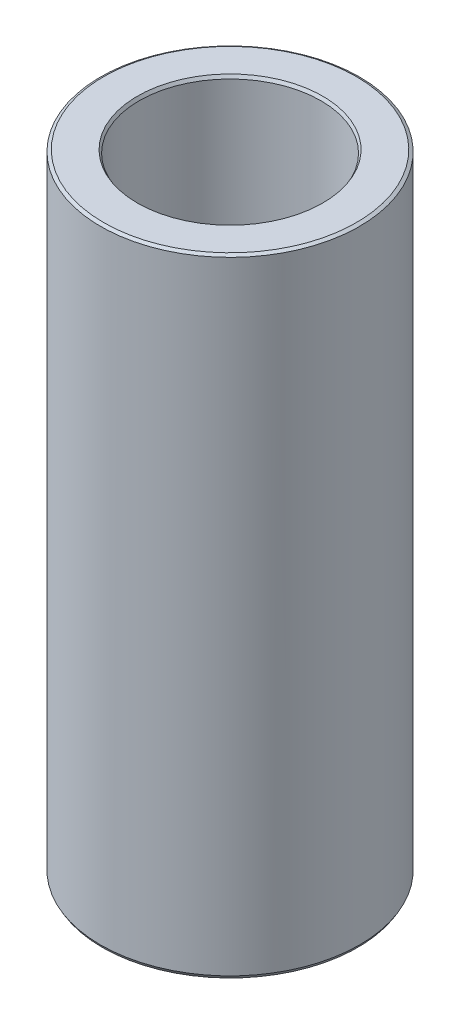
ISO-10303-21;
HEADER;
FILE_DESCRIPTION(('STEP AP214'),'2;1');
FILE_NAME('part.step','',(''),(''),'','','');
FILE_SCHEMA(('AUTOMOTIVE_DESIGN { 1 0 10303 214 1 1 1 1 }'));
ENDSEC;
DATA;
#1=APPLICATION_CONTEXT('core data for automotive mechanical design processes');
#2=APPLICATION_PROTOCOL_DEFINITION('international standard','automotive_design',2000,#1);
#3=PRODUCT_CONTEXT('',#1,'mechanical');
#4=PRODUCT('Part','Part','',(#3));
#5=PRODUCT_RELATED_PRODUCT_CATEGORY('part','',(#4));
#6=PRODUCT_DEFINITION_FORMATION('','',#4);
#7=PRODUCT_DEFINITION_CONTEXT('part definition',#1,'design');
#8=PRODUCT_DEFINITION('design','',#6,#7);
#9=PRODUCT_DEFINITION_SHAPE('','',#8);
#10=(LENGTH_UNIT() NAMED_UNIT(*) SI_UNIT(.MILLI.,.METRE.));
#11=(NAMED_UNIT(*) PLANE_ANGLE_UNIT() SI_UNIT($,.RADIAN.));
#12=(NAMED_UNIT(*) SI_UNIT($,.STERADIAN.) SOLID_ANGLE_UNIT());
#13=UNCERTAINTY_MEASURE_WITH_UNIT(LENGTH_MEASURE(1.E-05),#10,'distance_accuracy_value','');
#14=(GEOMETRIC_REPRESENTATION_CONTEXT(3) GLOBAL_UNCERTAINTY_ASSIGNED_CONTEXT((#13)) GLOBAL_UNIT_ASSIGNED_CONTEXT((#10,
#11,#12)) REPRESENTATION_CONTEXT('',''));
#15=CARTESIAN_POINT('',(0.,0.,0.));
#16=DIRECTION('',(0.,0.,1.));
#17=DIRECTION('',(1.,0.,0.));
#18=AXIS2_PLACEMENT_3D('',#15,#16,#17);
#19=CARTESIAN_POINT('',(0.,254.278853801829,0.));
#20=DIRECTION('',(0.,-1.,0.));
#21=DIRECTION('',(0.,0.,-1.));
#22=AXIS2_PLACEMENT_3D('',#19,#20,#21);
#23=CYLINDRICAL_SURFACE('',#22,52.5);
#24=CARTESIAN_POINT('',(0.,1.24987538682203,0.));
#25=DIRECTION('',(0.,1.,0.));
#26=DIRECTION('',(0.,0.,1.));
#27=AXIS2_PLACEMENT_3D('',#24,#25,#26);
#28=CIRCLE('',#27,52.5);
#29=CARTESIAN_POINT('',(0.,1.24987538682203,52.5));
#30=VERTEX_POINT('',#29);
#31=EDGE_CURVE('E10',#30,#30,#28,.T.);
#32=ORIENTED_EDGE('',*,*,#31,.T.);
#33=EDGE_LOOP('',(#32));
#34=FACE_BOUND('',#33,.T.);
#35=CARTESIAN_POINT('',(0.,253.557237910794,0.));
#36=DIRECTION('',(0.,1.,0.));
#37=DIRECTION('',(0.,0.,1.));
#38=AXIS2_PLACEMENT_3D('',#35,#36,#37);
#39=CIRCLE('',#38,52.5);
#40=CARTESIAN_POINT('',(0.,253.557237910793,-52.5));
#41=VERTEX_POINT('',#40);
#42=EDGE_CURVE('E50',#41,#41,#39,.F.);
#43=ORIENTED_EDGE('',*,*,#42,.T.);
#44=EDGE_LOOP('',(#43));
#45=FACE_BOUND('',#44,.T.);
#46=ADVANCED_FACE('F39',(#34,#45),#23,.T.);
#47=CARTESIAN_POINT('',(0.,254.278853801829,0.));
#48=DIRECTION('',(0.,1.,0.));
#49=DIRECTION('',(0.,0.,1.));
#50=AXIS2_PLACEMENT_3D('',#47,#48,#49);
#51=PLANE('',#50);
#52=CARTESIAN_POINT('',(0.,254.278853801829,0.));
#53=DIRECTION('',(0.,1.,0.));
#54=DIRECTION('',(0.,0.,1.));
#55=AXIS2_PLACEMENT_3D('',#52,#53,#54);
#56=CIRCLE('',#55,37.5683366560785);
#57=CARTESIAN_POINT('',(0.,254.278853801829,37.5683366560785));
#58=VERTEX_POINT('',#57);
#59=EDGE_CURVE('E58',#58,#58,#56,.F.);
#60=ORIENTED_EDGE('',*,*,#59,.T.);
#61=EDGE_LOOP('',(#60));
#62=FACE_BOUND('',#61,.T.);
#63=CARTESIAN_POINT('',(0.,254.278853801829,0.));
#64=DIRECTION('',(0.,1.,0.));
#65=DIRECTION('',(0.,0.,1.));
#66=AXIS2_PLACEMENT_3D('',#63,#64,#65);
#67=CIRCLE('',#66,51.2501246131779);
#68=CARTESIAN_POINT('',(0.,254.278853801829,-51.2501246131779));
#69=VERTEX_POINT('',#68);
#70=EDGE_CURVE('E61',#69,#69,#67,.T.);
#71=ORIENTED_EDGE('',*,*,#70,.T.);
#72=EDGE_LOOP('',(#71));
#73=FACE_BOUND('',#72,.T.);
#74=ADVANCED_FACE('F88',(#62,#73),#51,.T.);
#75=CARTESIAN_POINT('',(0.,0.,0.));
#76=DIRECTION('',(0.,1.,0.));
#77=DIRECTION('',(0.,0.,1.));
#78=AXIS2_PLACEMENT_3D('',#75,#76,#77);
#79=PLANE('',#78);
#80=CARTESIAN_POINT('',(0.,0.,0.));
#81=DIRECTION('',(0.,1.,0.));
#82=DIRECTION('',(0.,0.,1.));
#83=AXIS2_PLACEMENT_3D('',#80,#81,#82);
#84=CIRCLE('',#83,38.0965961518653);
#85=CARTESIAN_POINT('',(0.,0.,38.0965961518653));
#86=VERTEX_POINT('',#85);
#87=EDGE_CURVE('E51',#86,#86,#84,.T.);
#88=ORIENTED_EDGE('',*,*,#87,.T.);
#89=EDGE_LOOP('',(#88));
#90=FACE_BOUND('',#89,.T.);
#91=CARTESIAN_POINT('',(0.,0.,0.));
#92=DIRECTION('',(0.,1.,0.));
#93=DIRECTION('',(0.,0.,1.));
#94=AXIS2_PLACEMENT_3D('',#91,#92,#93);
#95=CIRCLE('',#94,51.7783841089648);
#96=CARTESIAN_POINT('',(0.,0.,51.7783841089648));
#97=VERTEX_POINT('',#96);
#98=EDGE_CURVE('E54',#97,#97,#95,.F.);
#99=ORIENTED_EDGE('',*,*,#98,.T.);
#100=EDGE_LOOP('',(#99));
#101=FACE_BOUND('',#100,.T.);
#102=ADVANCED_FACE('F83',(#90,#101),#79,.F.);
#103=CARTESIAN_POINT('',(0.,254.278853801829,0.));
#104=DIRECTION('',(0.,-1.,0.));
#105=DIRECTION('',(0.,0.,-1.));
#106=AXIS2_PLACEMENT_3D('',#103,#104,#105);
#107=CYLINDRICAL_SURFACE('',#106,36.8467207650432);
#108=CARTESIAN_POINT('',(0.,253.028978415007,0.));
#109=DIRECTION('',(0.,1.,0.));
#110=DIRECTION('',(0.,0.,1.));
#111=AXIS2_PLACEMENT_3D('',#108,#109,#110);
#112=CIRCLE('',#111,36.8467207650432);
#113=CARTESIAN_POINT('',(0.,253.028978415007,36.8467207650432));
#114=VERTEX_POINT('',#113);
#115=EDGE_CURVE('E67',#114,#114,#112,.T.);
#116=ORIENTED_EDGE('',*,*,#115,.T.);
#117=EDGE_LOOP('',(#116));
#118=FACE_BOUND('',#117,.T.);
#119=CARTESIAN_POINT('',(0.,0.721615891035199,0.));
#120=DIRECTION('',(0.,1.,0.));
#121=DIRECTION('',(0.,0.,1.));
#122=AXIS2_PLACEMENT_3D('',#119,#120,#121);
#123=CIRCLE('',#122,36.8467207650432);
#124=CARTESIAN_POINT('',(0.,0.721615891035199,36.8467207650432));
#125=VERTEX_POINT('',#124);
#126=EDGE_CURVE('E69',#125,#125,#123,.F.);
#127=ORIENTED_EDGE('',*,*,#126,.T.);
#128=EDGE_LOOP('',(#127));
#129=FACE_BOUND('',#128,.T.);
#130=ADVANCED_FACE('F71',(#118,#129),#107,.F.);
#131=CARTESIAN_POINT('',(0.,253.028978415007,0.));
#132=DIRECTION('',(0.,1.,0.));
#133=DIRECTION('',(0.,0.,1.));
#134=AXIS2_PLACEMENT_3D('',#131,#132,#133);
#135=CONICAL_SURFACE('',#134,36.8467207650432,0.523598775598297);
#136=ORIENTED_EDGE('',*,*,#59,.F.);
#137=EDGE_LOOP('',(#136));
#138=FACE_BOUND('',#137,.T.);
#139=ORIENTED_EDGE('',*,*,#115,.F.);
#140=EDGE_LOOP('',(#139));
#141=FACE_BOUND('',#140,.T.);
#142=ADVANCED_FACE('F77',(#138,#141),#135,.F.);
#143=CARTESIAN_POINT('',(0.,0.,0.));
#144=DIRECTION('',(0.,-1.,0.));
#145=DIRECTION('',(0.,0.,-1.));
#146=AXIS2_PLACEMENT_3D('',#143,#144,#145);
#147=CONICAL_SURFACE('',#146,38.0965961518653,1.04719755119661);
#148=ORIENTED_EDGE('',*,*,#126,.F.);
#149=EDGE_LOOP('',(#148));
#150=FACE_BOUND('',#149,.T.);
#151=ORIENTED_EDGE('',*,*,#87,.F.);
#152=EDGE_LOOP('',(#151));
#153=FACE_BOUND('',#152,.T.);
#154=ADVANCED_FACE('F73',(#150,#153),#147,.F.);
#155=CARTESIAN_POINT('',(0.,1.24987538682203,0.));
#156=DIRECTION('',(0.,1.,0.));
#157=DIRECTION('',(0.,0.,1.));
#158=AXIS2_PLACEMENT_3D('',#155,#156,#157);
#159=CONICAL_SURFACE('',#158,52.5,0.523598775598319);
#160=ORIENTED_EDGE('',*,*,#98,.F.);
#161=EDGE_LOOP('',(#160));
#162=FACE_BOUND('',#161,.T.);
#163=ORIENTED_EDGE('',*,*,#31,.F.);
#164=EDGE_LOOP('',(#163));
#165=FACE_BOUND('',#164,.T.);
#166=ADVANCED_FACE('F76',(#162,#165),#159,.T.);
#167=CARTESIAN_POINT('',(0.,254.278853801829,0.));
#168=DIRECTION('',(0.,-1.,0.));
#169=DIRECTION('',(0.,0.,-1.));
#170=AXIS2_PLACEMENT_3D('',#167,#168,#169);
#171=CONICAL_SURFACE('',#170,51.2501246131779,1.04719755119656);
#172=CARTESIAN_POINT('',(0.,253.557237910793,-52.5));
#173=CARTESIAN_POINT('',(0.,253.564754742992,-52.4869804647207));
#174=CARTESIAN_POINT('',(0.,253.57227157519,-52.4739609294413));
#175=CARTESIAN_POINT('',(0.,253.587305239587,-52.4479218588825));
#176=CARTESIAN_POINT('',(0.,253.594822071785,-52.4349023236031));
#177=CARTESIAN_POINT('',(0.,253.609855736181,-52.4088632530443));
#178=CARTESIAN_POINT('',(0.,253.61737256838,-52.3958437177649));
#179=CARTESIAN_POINT('',(0.,253.632406232776,-52.3698046472061));
#180=CARTESIAN_POINT('',(0.,253.639923064975,-52.3567851119267));
#181=CARTESIAN_POINT('',(0.,253.654956729371,-52.3307460413679));
#182=CARTESIAN_POINT('',(0.,253.662473561569,-52.3177265060885));
#183=CARTESIAN_POINT('',(0.,253.677507225966,-52.2916874355297));
#184=CARTESIAN_POINT('',(0.,253.685024058164,-52.2786679002503));
#185=CARTESIAN_POINT('',(0.,253.700057722561,-52.2526288296915));
#186=CARTESIAN_POINT('',(0.,253.707574554759,-52.2396092944121));
#187=CARTESIAN_POINT('',(0.,253.722608219156,-52.2135702238533));
#188=CARTESIAN_POINT('',(0.,253.730125051354,-52.2005506885739));
#189=CARTESIAN_POINT('',(0.,253.745158715751,-52.1745116180151));
#190=CARTESIAN_POINT('',(0.,253.752675547949,-52.1614920827357));
#191=CARTESIAN_POINT('',(0.,253.767709212345,-52.1354530121769));
#192=CARTESIAN_POINT('',(0.,253.775226044544,-52.1224334768975));
#193=CARTESIAN_POINT('',(0.,253.79025970894,-52.0963944063387));
#194=CARTESIAN_POINT('',(0.,253.797776541139,-52.0833748710593));
#195=CARTESIAN_POINT('',(0.,253.812810205535,-52.0573358005005));
#196=CARTESIAN_POINT('',(0.,253.820327037733,-52.0443162652211));
#197=CARTESIAN_POINT('',(0.,253.83536070213,-52.0182771946623));
#198=CARTESIAN_POINT('',(0.,253.842877534328,-52.0052576593829));
#199=CARTESIAN_POINT('',(0.,253.857911198725,-51.9792185888242));
#200=CARTESIAN_POINT('',(0.,253.865428030923,-51.9661990535447));
#201=CARTESIAN_POINT('',(0.,253.88046169532,-51.940159982986));
#202=CARTESIAN_POINT('',(0.,253.887978527518,-51.9271404477066));
#203=CARTESIAN_POINT('',(0.,253.903012191915,-51.9011013771478));
#204=CARTESIAN_POINT('',(0.,253.910529024113,-51.8880818418684));
#205=CARTESIAN_POINT('',(0.,253.925562688509,-51.8620427713096));
#206=CARTESIAN_POINT('',(0.,253.933079520708,-51.8490232360302));
#207=CARTESIAN_POINT('',(0.,253.948113185104,-51.8229841654714));
#208=CARTESIAN_POINT('',(0.,253.955630017303,-51.809964630192));
#209=CARTESIAN_POINT('',(0.,253.970663681699,-51.7839255596332));
#210=CARTESIAN_POINT('',(0.,253.978180513897,-51.7709060243538));
#211=CARTESIAN_POINT('',(0.,253.993214178294,-51.744866953795));
#212=CARTESIAN_POINT('',(0.,254.000731010492,-51.7318474185156));
#213=CARTESIAN_POINT('',(0.,254.015764674889,-51.7058083479568));
#214=CARTESIAN_POINT('',(0.,254.023281507087,-51.6927888126774));
#215=CARTESIAN_POINT('',(0.,254.038315171484,-51.6667497421186));
#216=CARTESIAN_POINT('',(0.,254.045832003682,-51.6537302068392));
#217=CARTESIAN_POINT('',(0.,254.060865668079,-51.6276911362804));
#218=CARTESIAN_POINT('',(0.,254.068382500277,-51.614671601001));
#219=CARTESIAN_POINT('',(0.,254.083416164673,-51.5886325304422));
#220=CARTESIAN_POINT('',(0.,254.090932996872,-51.5756129951628));
#221=CARTESIAN_POINT('',(0.,254.105966661268,-51.549573924604));
#222=CARTESIAN_POINT('',(0.,254.113483493467,-51.5365543893246));
#223=CARTESIAN_POINT('',(0.,254.128517157863,-51.5105153187658));
#224=CARTESIAN_POINT('',(0.,254.136033990061,-51.4974957834865));
#225=CARTESIAN_POINT('',(0.,254.151067654458,-51.4714567129277));
#226=CARTESIAN_POINT('',(0.,254.158584486656,-51.4584371776482));
#227=CARTESIAN_POINT('',(0.,254.173618151053,-51.4323981070895));
#228=CARTESIAN_POINT('',(0.,254.181134983251,-51.4193785718101));
#229=CARTESIAN_POINT('',(0.,254.196168647648,-51.3933395012513));
#230=CARTESIAN_POINT('',(0.,254.203685479846,-51.3803199659719));
#231=CARTESIAN_POINT('',(0.,254.218719144243,-51.3542808954131));
#232=CARTESIAN_POINT('',(0.,254.226235976441,-51.3412613601337));
#233=CARTESIAN_POINT('',(0.,254.241269640837,-51.3152222895749));
#234=CARTESIAN_POINT('',(0.,254.248786473036,-51.3022027542955));
#235=CARTESIAN_POINT('',(0.,254.263820137432,-51.2761636837367));
#236=CARTESIAN_POINT('',(0.,254.271336969631,-51.2631441484573));
#237=CARTESIAN_POINT('',(0.,254.278853801829,-51.2501246131779));
#238=B_SPLINE_CURVE_WITH_KNOTS('',3,(#172,#173,#174,#175,#176,#177,#178,#179,#180,#181,#182,
#183,#184,#185,#186,#187,#188,#189,#190,#191,#192,#193,#194,#195,#196,#197,#198,#199,#200,#201,
#202,#203,#204,#205,#206,#207,#208,#209,#210,#211,#212,#213,#214,#215,#216,#217,#218,#219,#220,
#221,#222,#223,#224,#225,#226,#227,#228,#229,#230,#231,#232,#233,#234,#235,#236,#237),
.UNSPECIFIED.,.F.,.F.,(4,2,2,2,2,2,2,2,2,2,2,2,2,2,2,2,2,2,2,2,2,2,2,2,2,2,2,2,2,2,2,2,4),(0.,
0.0451009931897221,0.0902019863794164,0.135302979569133,0.180403972758827,0.225504965948549,
0.270605959138243,0.315706952327932,0.360807945517654,0.405908938707348,0.45100993189707,
0.496110925086764,0.541211918276453,0.586312911466175,0.631413904655869,0.676514897845591,
0.721615891035285,0.766716884224974,0.811817877414696,0.85691887060439,0.902019863794112,
0.9471208569838,0.992221850173495,1.03732284336322,1.08242383655291,1.12752482974263,
1.17262582293232,1.21772681612202,1.26282780931174,1.30792880250143,1.35302979569115,
1.39813078888084,1.44323178207056),.UNSPECIFIED.);
#239=EDGE_CURVE('BSEAM45',#41,#69,#238,.T.);
#240=ORIENTED_EDGE('',*,*,#42,.F.);
#241=ORIENTED_EDGE('',*,*,#70,.F.);
#242=ORIENTED_EDGE('',*,*,#239,.T.);
#243=ORIENTED_EDGE('',*,*,#239,.F.);
#244=EDGE_LOOP('',(#240,#242,#241,#243));
#245=FACE_BOUND('',#244,.T.);
#246=ADVANCED_FACE('F45',(#245),#171,.T.);
#247=CLOSED_SHELL('',(#46,#74,#102,#130,#142,#154,#166,#246));
#248=MANIFOLD_SOLID_BREP('B2',#247);
#249=ADVANCED_BREP_SHAPE_REPRESENTATION('',(#18,#248),#14);
#250=SHAPE_DEFINITION_REPRESENTATION(#9,#249);
ENDSEC;
END-ISO-10303-21;
